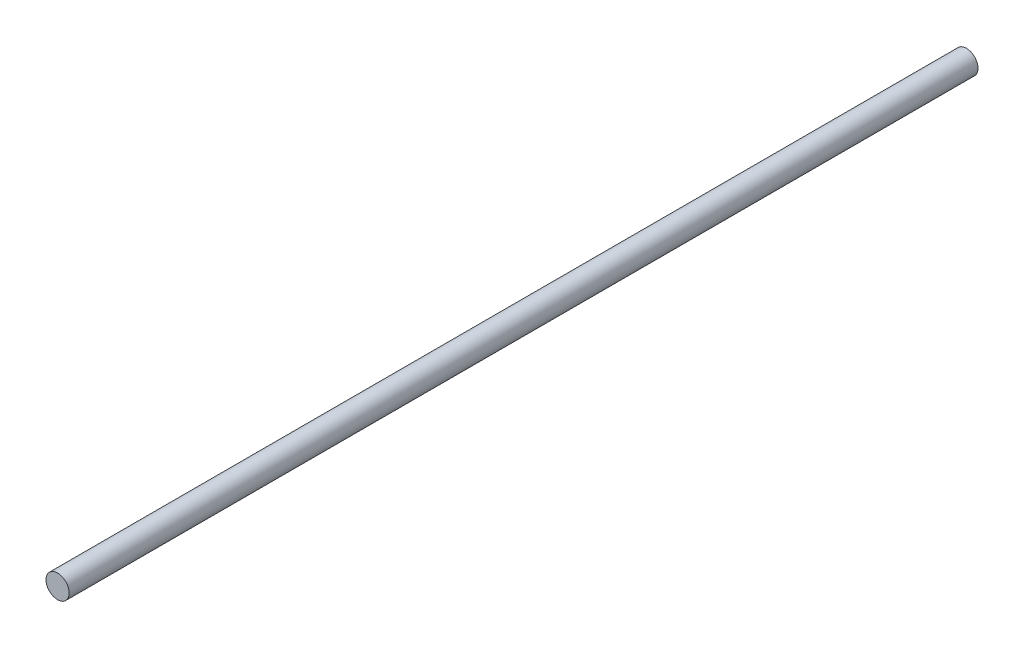
ISO-10303-21;
HEADER;
FILE_DESCRIPTION(('STEP AP214'),'2;1');
FILE_NAME('part.step','',(''),(''),'','','');
FILE_SCHEMA(('AUTOMOTIVE_DESIGN { 1 0 10303 214 1 1 1 1 }'));
ENDSEC;
DATA;
#1=APPLICATION_CONTEXT('core data for automotive mechanical design processes');
#2=APPLICATION_PROTOCOL_DEFINITION('international standard','automotive_design',2000,#1);
#3=PRODUCT_CONTEXT('',#1,'mechanical');
#4=PRODUCT('Part','Part','',(#3));
#5=PRODUCT_RELATED_PRODUCT_CATEGORY('part','',(#4));
#6=PRODUCT_DEFINITION_FORMATION('','',#4);
#7=PRODUCT_DEFINITION_CONTEXT('part definition',#1,'design');
#8=PRODUCT_DEFINITION('design','',#6,#7);
#9=PRODUCT_DEFINITION_SHAPE('','',#8);
#10=(LENGTH_UNIT() NAMED_UNIT(*) SI_UNIT(.MILLI.,.METRE.));
#11=(NAMED_UNIT(*) PLANE_ANGLE_UNIT() SI_UNIT($,.RADIAN.));
#12=(NAMED_UNIT(*) SI_UNIT($,.STERADIAN.) SOLID_ANGLE_UNIT());
#13=UNCERTAINTY_MEASURE_WITH_UNIT(LENGTH_MEASURE(1.E-05),#10,'distance_accuracy_value','');
#14=(GEOMETRIC_REPRESENTATION_CONTEXT(3) GLOBAL_UNCERTAINTY_ASSIGNED_CONTEXT((#13)) GLOBAL_UNIT_ASSIGNED_CONTEXT((#10,
#11,#12)) REPRESENTATION_CONTEXT('',''));
#15=CARTESIAN_POINT('',(0.,0.,0.));
#16=DIRECTION('',(0.,0.,1.));
#17=DIRECTION('',(1.,0.,0.));
#18=AXIS2_PLACEMENT_3D('',#15,#16,#17);
#19=CARTESIAN_POINT('',(0.,0.,310.));
#20=DIRECTION('',(0.,0.,-1.));
#21=DIRECTION('',(-1.,0.,0.));
#22=AXIS2_PLACEMENT_3D('',#19,#20,#21);
#23=CYLINDRICAL_SURFACE('',#22,3.95);
#24=CARTESIAN_POINT('',(0.,0.,310.));
#25=DIRECTION('',(0.,0.,1.));
#26=DIRECTION('',(1.,0.,0.));
#27=AXIS2_PLACEMENT_3D('',#24,#25,#26);
#28=CIRCLE('',#27,3.95);
#29=CARTESIAN_POINT('',(3.95,0.,310.));
#30=VERTEX_POINT('',#29);
#31=EDGE_CURVE('E10',#30,#30,#28,.T.);
#32=ORIENTED_EDGE('',*,*,#31,.F.);
#33=EDGE_LOOP('',(#32));
#34=FACE_BOUND('',#33,.T.);
#35=CARTESIAN_POINT('',(0.,0.,0.));
#36=DIRECTION('',(0.,0.,1.));
#37=DIRECTION('',(1.,0.,0.));
#38=AXIS2_PLACEMENT_3D('',#35,#36,#37);
#39=CIRCLE('',#38,3.95);
#40=CARTESIAN_POINT('',(3.95,0.,0.));
#41=VERTEX_POINT('',#40);
#42=EDGE_CURVE('E39',#41,#41,#39,.T.);
#43=ORIENTED_EDGE('',*,*,#42,.T.);
#44=EDGE_LOOP('',(#43));
#45=FACE_BOUND('',#44,.T.);
#46=ADVANCED_FACE('F36',(#34,#45),#23,.T.);
#47=CARTESIAN_POINT('',(0.,0.,310.));
#48=DIRECTION('',(0.,0.,1.));
#49=DIRECTION('',(1.,0.,0.));
#50=AXIS2_PLACEMENT_3D('',#47,#48,#49);
#51=PLANE('',#50);
#52=ORIENTED_EDGE('',*,*,#31,.T.);
#53=EDGE_LOOP('',(#52));
#54=FACE_BOUND('',#53,.T.);
#55=ADVANCED_FACE('F51',(#54),#51,.T.);
#56=CARTESIAN_POINT('',(0.,0.,0.));
#57=DIRECTION('',(0.,0.,1.));
#58=DIRECTION('',(1.,0.,0.));
#59=AXIS2_PLACEMENT_3D('',#56,#57,#58);
#60=PLANE('',#59);
#61=ORIENTED_EDGE('',*,*,#42,.F.);
#62=EDGE_LOOP('',(#61));
#63=FACE_BOUND('',#62,.T.);
#64=ADVANCED_FACE('F49',(#63),#60,.F.);
#65=CLOSED_SHELL('',(#46,#55,#64));
#66=MANIFOLD_SOLID_BREP('B2',#65);
#67=ADVANCED_BREP_SHAPE_REPRESENTATION('',(#18,#66),#14);
#68=SHAPE_DEFINITION_REPRESENTATION(#9,#67);
ENDSEC;
END-ISO-10303-21;
